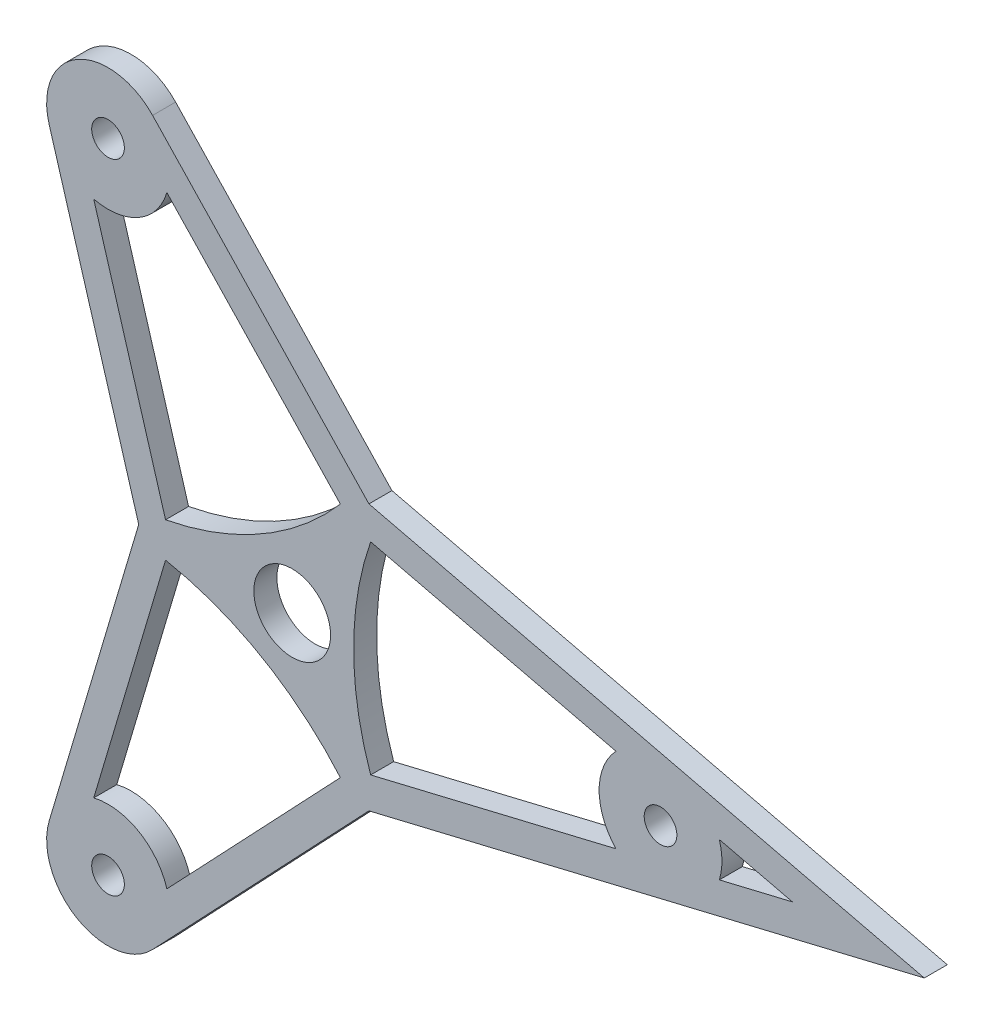
ISO-10303-21;
HEADER;
FILE_DESCRIPTION(('STEP AP214'),'2;1');
FILE_NAME('part.step','',(''),(''),'','','');
FILE_SCHEMA(('AUTOMOTIVE_DESIGN { 1 0 10303 214 1 1 1 1 }'));
ENDSEC;
DATA;
#1=APPLICATION_CONTEXT('core data for automotive mechanical design processes');
#2=APPLICATION_PROTOCOL_DEFINITION('international standard','automotive_design',2000,#1);
#3=PRODUCT_CONTEXT('',#1,'mechanical');
#4=PRODUCT('Part','Part','',(#3));
#5=PRODUCT_RELATED_PRODUCT_CATEGORY('part','',(#4));
#6=PRODUCT_DEFINITION_FORMATION('','',#4);
#7=PRODUCT_DEFINITION_CONTEXT('part definition',#1,'design');
#8=PRODUCT_DEFINITION('design','',#6,#7);
#9=PRODUCT_DEFINITION_SHAPE('','',#8);
#10=(LENGTH_UNIT() NAMED_UNIT(*) SI_UNIT(.MILLI.,.METRE.));
#11=(NAMED_UNIT(*) PLANE_ANGLE_UNIT() SI_UNIT($,.RADIAN.));
#12=(NAMED_UNIT(*) SI_UNIT($,.STERADIAN.) SOLID_ANGLE_UNIT());
#13=UNCERTAINTY_MEASURE_WITH_UNIT(LENGTH_MEASURE(1.E-05),#10,'distance_accuracy_value','');
#14=(GEOMETRIC_REPRESENTATION_CONTEXT(3) GLOBAL_UNCERTAINTY_ASSIGNED_CONTEXT((#13)) GLOBAL_UNIT_ASSIGNED_CONTEXT((#10,
#11,#12)) REPRESENTATION_CONTEXT('',''));
#15=CARTESIAN_POINT('',(0.,0.,0.));
#16=DIRECTION('',(0.,0.,1.));
#17=DIRECTION('',(1.,0.,0.));
#18=AXIS2_PLACEMENT_3D('',#15,#16,#17);
#19=CARTESIAN_POINT('',(-31.75,0.,-4.7625));
#20=DIRECTION('',(-0.958618679777918,0.284693215199875,0.));
#21=DIRECTION('',(-0.284693215199875,-0.958618679777918,0.));
#22=AXIS2_PLACEMENT_3D('',#19,#20,#21);
#23=PLANE('',#22);
#24=DIRECTION('',(-0.284693215199875,-0.958618679777918,0.));
#25=VECTOR('',#24,1.);
#26=CARTESIAN_POINT('',(-31.75,0.,0.));
#27=LINE('',#26,#25);
#28=CARTESIAN_POINT('',(-31.75,0.,0.));
#29=VERTEX_POINT('',#28);
#30=CARTESIAN_POINT('',(-50.2744572331796,-62.3755319353353,0.));
#31=VERTEX_POINT('',#30);
#32=EDGE_CURVE('E377',#29,#31,#27,.T.);
#33=ORIENTED_EDGE('',*,*,#32,.F.);
#34=DIRECTION('',(0.,0.,1.));
#35=VECTOR('',#34,1.);
#36=CARTESIAN_POINT('',(-31.75,0.,-4.7625));
#37=LINE('',#36,#35);
#38=CARTESIAN_POINT('',(-31.75,0.,-4.7625));
#39=VERTEX_POINT('',#38);
#40=EDGE_CURVE('E11',#39,#29,#37,.T.);
#41=ORIENTED_EDGE('',*,*,#40,.F.);
#42=DIRECTION('',(-0.284693215199875,-0.958618679777918,0.));
#43=VECTOR('',#42,1.);
#44=CARTESIAN_POINT('',(-31.75,0.,-4.7625));
#45=LINE('',#44,#43);
#46=CARTESIAN_POINT('',(-50.2744572331796,-62.3755319353353,-4.7625));
#47=VERTEX_POINT('',#46);
#48=EDGE_CURVE('E381',#39,#47,#45,.T.);
#49=ORIENTED_EDGE('',*,*,#48,.T.);
#50=DIRECTION('',(0.,0.,1.));
#51=VECTOR('',#50,1.);
#52=CARTESIAN_POINT('',(-50.2744572331796,-62.3755319353353,-4.7625));
#53=LINE('',#52,#51);
#54=EDGE_CURVE('E45',#47,#31,#53,.T.);
#55=ORIENTED_EDGE('',*,*,#54,.T.);
#56=EDGE_LOOP('',(#33,#41,#49,#55));
#57=FACE_BOUND('',#56,.T.);
#58=ADVANCED_FACE('F42',(#57),#23,.T.);
#59=CARTESIAN_POINT('',(-31.75,0.,-4.7625));
#60=DIRECTION('',(-0.95861867977792,-0.284693215199867,0.));
#61=DIRECTION('',(0.284693215199867,-0.95861867977792,0.));
#62=AXIS2_PLACEMENT_3D('',#59,#60,#61);
#63=PLANE('',#62);
#64=DIRECTION('',(0.284693215199867,-0.95861867977792,0.));
#65=VECTOR('',#64,1.);
#66=CARTESIAN_POINT('',(-31.75,0.,0.));
#67=LINE('',#66,#65);
#68=CARTESIAN_POINT('',(-50.2744572331791,62.3755319353358,0.));
#69=VERTEX_POINT('',#68);
#70=EDGE_CURVE('E386',#69,#29,#67,.T.);
#71=ORIENTED_EDGE('',*,*,#70,.F.);
#72=DIRECTION('',(0.,0.,1.));
#73=VECTOR('',#72,1.);
#74=CARTESIAN_POINT('',(-50.2744572331791,62.3755319353358,-4.7625));
#75=LINE('',#74,#73);
#76=CARTESIAN_POINT('',(-50.2744572331791,62.3755319353358,-4.7625));
#77=VERTEX_POINT('',#76);
#78=EDGE_CURVE('E51',#77,#69,#75,.T.);
#79=ORIENTED_EDGE('',*,*,#78,.F.);
#80=DIRECTION('',(0.284693215199867,-0.95861867977792,0.));
#81=VECTOR('',#80,1.);
#82=CARTESIAN_POINT('',(-31.75,0.,-4.7625));
#83=LINE('',#82,#81);
#84=EDGE_CURVE('E408',#77,#39,#83,.T.);
#85=ORIENTED_EDGE('',*,*,#84,.T.);
#86=ORIENTED_EDGE('',*,*,#40,.T.);
#87=EDGE_LOOP('',(#71,#79,#85,#86));
#88=FACE_BOUND('',#87,.T.);
#89=ADVANCED_FACE('F477',(#88),#63,.T.);
#90=CARTESIAN_POINT('',(-38.0999999999996,65.9911357683741,-4.7625));
#91=DIRECTION('',(0.,0.,1.));
#92=DIRECTION('',(1.,0.,0.));
#93=AXIS2_PLACEMENT_3D('',#90,#91,#92);
#94=CYLINDRICAL_SURFACE('',#93,12.7);
#95=CARTESIAN_POINT('',(-38.0999999999996,65.9911357683741,0.));
#96=DIRECTION('',(0.,0.,1.));
#97=DIRECTION('',(1.,0.,0.));
#98=AXIS2_PLACEMENT_3D('',#95,#96,#97);
#99=CIRCLE('',#98,12.7);
#100=CARTESIAN_POINT('',(-28.8815666139781,74.7267230930756,0.));
#101=VERTEX_POINT('',#100);
#102=EDGE_CURVE('E435',#101,#69,#99,.T.);
#103=ORIENTED_EDGE('',*,*,#102,.F.);
#104=DIRECTION('',(0.,0.,1.));
#105=VECTOR('',#104,1.);
#106=CARTESIAN_POINT('',(-28.8815666139781,74.7267230930756,-4.7625));
#107=LINE('',#106,#105);
#108=CARTESIAN_POINT('',(-28.8815666139781,74.7267230930756,-4.7625));
#109=VERTEX_POINT('',#108);
#110=EDGE_CURVE('E444',#109,#101,#107,.T.);
#111=ORIENTED_EDGE('',*,*,#110,.F.);
#112=CARTESIAN_POINT('',(-38.0999999999996,65.9911357683741,-4.7625));
#113=DIRECTION('',(0.,0.,1.));
#114=DIRECTION('',(1.,0.,0.));
#115=AXIS2_PLACEMENT_3D('',#112,#113,#114);
#116=CIRCLE('',#115,12.7);
#117=EDGE_CURVE('E404',#109,#77,#116,.T.);
#118=ORIENTED_EDGE('',*,*,#117,.T.);
#119=ORIENTED_EDGE('',*,*,#78,.T.);
#120=EDGE_LOOP('',(#103,#111,#118,#119));
#121=FACE_BOUND('',#120,.T.);
#122=ADVANCED_FACE('F497',(#121),#94,.T.);
#123=CARTESIAN_POINT('',(15.8749999999999,27.496306570156,-4.7625));
#124=DIRECTION('',(0.725860896537122,0.687841521630038,0.));
#125=DIRECTION('',(-0.687841521630038,0.725860896537122,0.));
#126=AXIS2_PLACEMENT_3D('',#123,#124,#125);
#127=PLANE('',#126);
#128=DIRECTION('',(-0.687841521630038,0.725860896537122,0.));
#129=VECTOR('',#128,1.);
#130=CARTESIAN_POINT('',(15.8749999999999,27.496306570156,0.));
#131=LINE('',#130,#129);
#132=CARTESIAN_POINT('',(15.8749999999999,27.496306570156,0.));
#133=VERTEX_POINT('',#132);
#134=EDGE_CURVE('E431',#133,#101,#131,.T.);
#135=ORIENTED_EDGE('',*,*,#134,.F.);
#136=DIRECTION('',(0.,0.,1.));
#137=VECTOR('',#136,1.);
#138=CARTESIAN_POINT('',(15.8749999999999,27.496306570156,-4.7625));
#139=LINE('',#138,#137);
#140=CARTESIAN_POINT('',(15.8749999999999,27.496306570156,-4.7625));
#141=VERTEX_POINT('',#140);
#142=EDGE_CURVE('E447',#141,#133,#139,.T.);
#143=ORIENTED_EDGE('',*,*,#142,.F.);
#144=DIRECTION('',(-0.687841521630038,0.725860896537122,0.));
#145=VECTOR('',#144,1.);
#146=CARTESIAN_POINT('',(15.8749999999999,27.496306570156,-4.7625));
#147=LINE('',#146,#145);
#148=EDGE_CURVE('E400',#141,#109,#147,.T.);
#149=ORIENTED_EDGE('',*,*,#148,.T.);
#150=ORIENTED_EDGE('',*,*,#110,.T.);
#151=EDGE_LOOP('',(#135,#143,#149,#150));
#152=FACE_BOUND('',#151,.T.);
#153=ADVANCED_FACE('F495',(#152),#127,.T.);
#154=CARTESIAN_POINT('',(15.8749999999999,27.496306570156,-4.7625));
#155=DIRECTION('',(0.232757783240804,0.972534736829912,0.));
#156=DIRECTION('',(-0.972534736829913,0.232757783240804,0.));
#157=AXIS2_PLACEMENT_3D('',#154,#155,#156);
#158=PLANE('',#157);
#159=DIRECTION('',(-0.972534736829912,0.232757783240804,0.));
#160=VECTOR('',#159,1.);
#161=CARTESIAN_POINT('',(15.8749999999999,27.496306570156,0.));
#162=LINE('',#161,#160);
#163=CARTESIAN_POINT('',(130.763159277303,-3.24393301264684E-13,0.));
#164=VERTEX_POINT('',#163);
#165=EDGE_CURVE('E427',#164,#133,#162,.T.);
#166=ORIENTED_EDGE('',*,*,#165,.F.);
#167=DIRECTION('',(0.,0.,1.));
#168=VECTOR('',#167,1.);
#169=CARTESIAN_POINT('',(130.763159277303,-3.24393301264684E-13,-4.7625));
#170=LINE('',#169,#168);
#171=CARTESIAN_POINT('',(130.763159277303,-3.24393301264684E-13,-4.7625));
#172=VERTEX_POINT('',#171);
#173=EDGE_CURVE('E450',#172,#164,#170,.T.);
#174=ORIENTED_EDGE('',*,*,#173,.F.);
#175=DIRECTION('',(-0.972534736829912,0.232757783240804,0.));
#176=VECTOR('',#175,1.);
#177=CARTESIAN_POINT('',(78.911198700198,12.4097854231473,-4.7625));
#178=LINE('',#177,#176);
#179=EDGE_CURVE('E397',#172,#141,#178,.T.);
#180=ORIENTED_EDGE('',*,*,#179,.T.);
#181=ORIENTED_EDGE('',*,*,#142,.T.);
#182=EDGE_LOOP('',(#166,#174,#180,#181));
#183=FACE_BOUND('',#182,.T.);
#184=ADVANCED_FACE('F490',(#183),#158,.T.);
#185=CARTESIAN_POINT('',(79.1560238471579,-12.3511911577401,-4.7625));
#186=DIRECTION('',(0.2327577832408,-0.972534736829913,0.));
#187=DIRECTION('',(0.972534736829913,0.2327577832408,0.));
#188=AXIS2_PLACEMENT_3D('',#185,#186,#187);
#189=PLANE('',#188);
#190=DIRECTION('',(0.972534736829913,0.2327577832408,0.));
#191=VECTOR('',#190,1.);
#192=CARTESIAN_POINT('',(79.1560238471579,-12.3511911577401,0.));
#193=LINE('',#192,#191);
#194=CARTESIAN_POINT('',(15.8749999999994,-27.4963065701563,0.));
#195=VERTEX_POINT('',#194);
#196=EDGE_CURVE('E423',#195,#164,#193,.T.);
#197=ORIENTED_EDGE('',*,*,#196,.F.);
#198=DIRECTION('',(0.,0.,1.));
#199=VECTOR('',#198,1.);
#200=CARTESIAN_POINT('',(15.8749999999994,-27.4963065701563,-4.7625));
#201=LINE('',#200,#199);
#202=CARTESIAN_POINT('',(15.8749999999994,-27.4963065701563,-4.7625));
#203=VERTEX_POINT('',#202);
#204=EDGE_CURVE('E454',#203,#195,#201,.T.);
#205=ORIENTED_EDGE('',*,*,#204,.F.);
#206=DIRECTION('',(0.972534736829913,0.2327577832408,0.));
#207=VECTOR('',#206,1.);
#208=CARTESIAN_POINT('',(15.8749999999994,-27.4963065701563,-4.7625));
#209=LINE('',#208,#207);
#210=EDGE_CURVE('E394',#203,#172,#209,.T.);
#211=ORIENTED_EDGE('',*,*,#210,.T.);
#212=ORIENTED_EDGE('',*,*,#173,.T.);
#213=EDGE_LOOP('',(#197,#205,#211,#212));
#214=FACE_BOUND('',#213,.T.);
#215=ADVANCED_FACE('F487',(#214),#189,.T.);
#216=CARTESIAN_POINT('',(15.8749999999994,-27.4963065701563,-4.7625));
#217=DIRECTION('',(0.725860896537117,-0.687841521630042,0.));
#218=DIRECTION('',(0.687841521630043,0.725860896537117,0.));
#219=AXIS2_PLACEMENT_3D('',#216,#217,#218);
#220=PLANE('',#219);
#221=DIRECTION('',(0.687841521630043,0.725860896537117,0.));
#222=VECTOR('',#221,1.);
#223=CARTESIAN_POINT('',(15.8749999999994,-27.4963065701563,0.));
#224=LINE('',#223,#222);
#225=CARTESIAN_POINT('',(-28.8815666139786,-74.7267230930753,0.));
#226=VERTEX_POINT('',#225);
#227=EDGE_CURVE('E419',#226,#195,#224,.T.);
#228=ORIENTED_EDGE('',*,*,#227,.F.);
#229=DIRECTION('',(0.,0.,1.));
#230=VECTOR('',#229,1.);
#231=CARTESIAN_POINT('',(-28.8815666139786,-74.7267230930753,-4.7625));
#232=LINE('',#231,#230);
#233=CARTESIAN_POINT('',(-28.8815666139786,-74.7267230930753,-4.7625));
#234=VERTEX_POINT('',#233);
#235=EDGE_CURVE('E457',#234,#226,#232,.T.);
#236=ORIENTED_EDGE('',*,*,#235,.F.);
#237=DIRECTION('',(0.687841521630043,0.725860896537117,0.));
#238=VECTOR('',#237,1.);
#239=CARTESIAN_POINT('',(15.8749999999994,-27.4963065701563,-4.7625));
#240=LINE('',#239,#238);
#241=EDGE_CURVE('E390',#234,#203,#240,.T.);
#242=ORIENTED_EDGE('',*,*,#241,.T.);
#243=ORIENTED_EDGE('',*,*,#204,.T.);
#244=EDGE_LOOP('',(#228,#236,#242,#243));
#245=FACE_BOUND('',#244,.T.);
#246=ADVANCED_FACE('F485',(#245),#220,.T.);
#247=CARTESIAN_POINT('',(-38.1,-65.9911357683737,-4.7625));
#248=DIRECTION('',(0.,0.,1.));
#249=DIRECTION('',(1.,0.,0.));
#250=AXIS2_PLACEMENT_3D('',#247,#248,#249);
#251=CYLINDRICAL_SURFACE('',#250,12.7);
#252=CARTESIAN_POINT('',(-38.1,-65.9911357683737,0.));
#253=DIRECTION('',(0.,0.,1.));
#254=DIRECTION('',(1.,0.,0.));
#255=AXIS2_PLACEMENT_3D('',#252,#253,#254);
#256=CIRCLE('',#255,12.7);
#257=EDGE_CURVE('E415',#31,#226,#256,.T.);
#258=ORIENTED_EDGE('',*,*,#257,.F.);
#259=ORIENTED_EDGE('',*,*,#54,.F.);
#260=CARTESIAN_POINT('',(-38.1,-65.9911357683737,-4.7625));
#261=DIRECTION('',(0.,0.,1.));
#262=DIRECTION('',(1.,0.,0.));
#263=AXIS2_PLACEMENT_3D('',#260,#261,#262);
#264=CIRCLE('',#263,12.7);
#265=EDGE_CURVE('E385',#47,#234,#264,.T.);
#266=ORIENTED_EDGE('',*,*,#265,.T.);
#267=ORIENTED_EDGE('',*,*,#235,.T.);
#268=EDGE_LOOP('',(#258,#259,#266,#267));
#269=FACE_BOUND('',#268,.T.);
#270=ADVANCED_FACE('F471',(#269),#251,.T.);
#271=CARTESIAN_POINT('',(-38.1,-65.9911357683737,-4.7625));
#272=DIRECTION('',(0.,0.,1.));
#273=DIRECTION('',(1.,0.,0.));
#274=AXIS2_PLACEMENT_3D('',#271,#272,#273);
#275=PLANE('',#274);
#276=CARTESIAN_POINT('',(76.2,0.,-4.7625));
#277=DIRECTION('',(0.,0.,1.));
#278=DIRECTION('',(1.,0.,0.));
#279=AXIS2_PLACEMENT_3D('',#276,#277,#278);
#280=CIRCLE('',#279,3.3782);
#281=CARTESIAN_POINT('',(79.5782,0.,-4.7625));
#282=VERTEX_POINT('',#281);
#283=EDGE_CURVE('E830',#282,#282,#280,.T.);
#284=ORIENTED_EDGE('',*,*,#283,.T.);
#285=EDGE_LOOP('',(#284));
#286=FACE_BOUND('',#285,.T.);
#287=CARTESIAN_POINT('',(-38.0999999999992,65.9911357683743,-4.7625));
#288=DIRECTION('',(0.,0.,1.));
#289=DIRECTION('',(1.,0.,0.));
#290=AXIS2_PLACEMENT_3D('',#287,#288,#289);
#291=CIRCLE('',#290,3.3782);
#292=CARTESIAN_POINT('',(-34.7217999999992,65.9911357683743,-4.7625));
#293=VERTEX_POINT('',#292);
#294=EDGE_CURVE('E845',#293,#293,#291,.T.);
#295=ORIENTED_EDGE('',*,*,#294,.T.);
#296=EDGE_LOOP('',(#295));
#297=FACE_BOUND('',#296,.T.);
#298=CARTESIAN_POINT('',(-38.0999999999997,-65.9911357683735,-4.7625));
#299=DIRECTION('',(0.,0.,1.));
#300=DIRECTION('',(1.,0.,0.));
#301=AXIS2_PLACEMENT_3D('',#298,#299,#300);
#302=CIRCLE('',#301,3.3782);
#303=CARTESIAN_POINT('',(-34.7217999999997,-65.9911357683735,-4.7625));
#304=VERTEX_POINT('',#303);
#305=EDGE_CURVE('E228',#304,#304,#302,.T.);
#306=ORIENTED_EDGE('',*,*,#305,.T.);
#307=EDGE_LOOP('',(#306));
#308=FACE_BOUND('',#307,.T.);
#309=DIRECTION('',(0.972534736829913,0.2327577832408,0.));
#310=VECTOR('',#309,1.);
#311=CARTESIAN_POINT('',(16.2316117473112,-20.8816285374198,-4.7625));
#312=LINE('',#311,#310);
#313=CARTESIAN_POINT('',(16.2316117473112,-20.8816285374198,-4.7625));
#314=VERTEX_POINT('',#313);
#315=CARTESIAN_POINT('',(66.9815666139783,-8.73558732470175,-4.7625));
#316=VERTEX_POINT('',#315);
#317=EDGE_CURVE('E207',#314,#316,#312,.T.);
#318=ORIENTED_EDGE('',*,*,#317,.T.);
#319=CARTESIAN_POINT('',(76.1999999999997,-2.17686979553376E-13,-4.7625));
#320=DIRECTION('',(0.,0.,-1.));
#321=DIRECTION('',(1.,0.,0.));
#322=AXIS2_PLACEMENT_3D('',#319,#320,#321);
#323=CIRCLE('',#322,12.7);
#324=CARTESIAN_POINT('',(66.9815666139783,8.73558732470135,-4.7625));
#325=VERTEX_POINT('',#324);
#326=EDGE_CURVE('E200',#316,#325,#323,.T.);
#327=ORIENTED_EDGE('',*,*,#326,.T.);
#328=DIRECTION('',(-0.972534736829913,0.232757783240804,0.));
#329=VECTOR('',#328,1.);
#330=CARTESIAN_POINT('',(16.2316117473113,20.8816285374197,-4.7625));
#331=LINE('',#330,#329);
#332=CARTESIAN_POINT('',(16.2316117473113,20.8816285374196,-4.7625));
#333=VERTEX_POINT('',#332);
#334=EDGE_CURVE('E210',#325,#333,#331,.T.);
#335=ORIENTED_EDGE('',*,*,#334,.T.);
#336=CARTESIAN_POINT('',(76.1999999999997,-2.17686979553376E-13,-4.7625));
#337=DIRECTION('',(0.,0.,1.));
#338=DIRECTION('',(1.,0.,0.));
#339=AXIS2_PLACEMENT_3D('',#336,#337,#338);
#340=CIRCLE('',#339,63.4999999999997);
#341=EDGE_CURVE('E59',#333,#314,#340,.T.);
#342=ORIENTED_EDGE('',*,*,#341,.T.);
#343=EDGE_LOOP('',(#318,#327,#335,#342));
#344=FACE_BOUND('',#343,.T.);
#345=DIRECTION('',(-0.284693215199875,-0.958618679777917,0.));
#346=VECTOR('',#345,1.);
#347=CARTESIAN_POINT('',(-26.1998266594511,-3.61617384882755,-4.7625));
#348=LINE('',#347,#346);
#349=CARTESIAN_POINT('',(-26.1998266594511,-3.61617384882756,-4.7625));
#350=VERTEX_POINT('',#349);
#351=CARTESIAN_POINT('',(-41.0560238471581,-53.6399446106338,-4.7625));
#352=VERTEX_POINT('',#351);
#353=EDGE_CURVE('E265',#350,#352,#348,.T.);
#354=ORIENTED_EDGE('',*,*,#353,.T.);
#355=CARTESIAN_POINT('',(-38.1,-65.9911357683737,-4.7625));
#356=DIRECTION('',(0.,0.,-1.));
#357=DIRECTION('',(1.,0.,0.));
#358=AXIS2_PLACEMENT_3D('',#355,#356,#357);
#359=CIRCLE('',#358,12.7);
#360=CARTESIAN_POINT('',(-25.9255427668204,-62.3755319353354,-4.7625));
#361=VERTEX_POINT('',#360);
#362=EDGE_CURVE('E252',#352,#361,#359,.T.);
#363=ORIENTED_EDGE('',*,*,#362,.T.);
#364=DIRECTION('',(0.687841521630043,0.725860896537117,0.));
#365=VECTOR('',#364,1.);
#366=CARTESIAN_POINT('',(9.96821491213968,-24.4978023862472,-4.7625));
#367=LINE('',#366,#365);
#368=CARTESIAN_POINT('',(9.96821491213969,-24.4978023862472,-4.7625));
#369=VERTEX_POINT('',#368);
#370=EDGE_CURVE('E256',#361,#369,#367,.T.);
#371=ORIENTED_EDGE('',*,*,#370,.T.);
#372=CARTESIAN_POINT('',(-38.1,-65.9911357683737,-4.7625));
#373=DIRECTION('',(0.,0.,1.));
#374=DIRECTION('',(1.,0.,0.));
#375=AXIS2_PLACEMENT_3D('',#372,#373,#374);
#376=CIRCLE('',#375,63.4999999999996);
#377=EDGE_CURVE('E261',#369,#350,#376,.T.);
#378=ORIENTED_EDGE('',*,*,#377,.T.);
#379=EDGE_LOOP('',(#354,#363,#371,#378));
#380=FACE_BOUND('',#379,.T.);
#381=DIRECTION('',(-0.972534736829912,0.232757783240804,0.));
#382=VECTOR('',#381,1.);
#383=CARTESIAN_POINT('',(88.3744572331793,3.61560383303811,-4.7625));
#384=LINE('',#383,#382);
#385=CARTESIAN_POINT('',(103.481579638652,-2.63677968348475E-13,-4.7625));
#386=VERTEX_POINT('',#385);
#387=CARTESIAN_POINT('',(88.3744572331793,3.61560383303811,-4.7625));
#388=VERTEX_POINT('',#387);
#389=EDGE_CURVE('E305',#386,#388,#384,.T.);
#390=ORIENTED_EDGE('',*,*,#389,.T.);
#391=CARTESIAN_POINT('',(76.1999999999997,-2.17686979553376E-13,-4.7625));
#392=DIRECTION('',(0.,0.,-1.));
#393=DIRECTION('',(1.,0.,0.));
#394=AXIS2_PLACEMENT_3D('',#391,#392,#393);
#395=CIRCLE('',#394,12.7);
#396=CARTESIAN_POINT('',(88.3744572331793,-3.61560383303859,-4.7625));
#397=VERTEX_POINT('',#396);
#398=EDGE_CURVE('E296',#388,#397,#395,.T.);
#399=ORIENTED_EDGE('',*,*,#398,.T.);
#400=DIRECTION('',(0.972534736829913,0.2327577832408,0.));
#401=VECTOR('',#400,1.);
#402=CARTESIAN_POINT('',(88.3744572331793,-3.61560383303859,-4.7625));
#403=LINE('',#402,#401);
#404=EDGE_CURVE('E300',#397,#386,#403,.T.);
#405=ORIENTED_EDGE('',*,*,#404,.T.);
#406=EDGE_LOOP('',(#390,#399,#405));
#407=FACE_BOUND('',#406,.T.);
#408=DIRECTION('',(-0.687841521630038,0.725860896537122,0.));
#409=VECTOR('',#408,1.);
#410=CARTESIAN_POINT('',(9.96821491213995,24.4978023862472,-4.7625));
#411=LINE('',#410,#409);
#412=CARTESIAN_POINT('',(9.96821491213995,24.4978023862472,-4.7625));
#413=VERTEX_POINT('',#412);
#414=CARTESIAN_POINT('',(-25.92554276682,62.3755319353357,-4.7625));
#415=VERTEX_POINT('',#414);
#416=EDGE_CURVE('E342',#413,#415,#411,.T.);
#417=ORIENTED_EDGE('',*,*,#416,.T.);
#418=CARTESIAN_POINT('',(-38.0999999999996,65.9911357683741,-4.7625));
#419=DIRECTION('',(0.,0.,-1.));
#420=DIRECTION('',(1.,0.,0.));
#421=AXIS2_PLACEMENT_3D('',#418,#419,#420);
#422=CIRCLE('',#421,12.7);
#423=CARTESIAN_POINT('',(-41.0560238471578,53.6399446106342,-4.7625));
#424=VERTEX_POINT('',#423);
#425=EDGE_CURVE('E329',#415,#424,#422,.T.);
#426=ORIENTED_EDGE('',*,*,#425,.T.);
#427=DIRECTION('',(0.284693215199867,-0.95861867977792,0.));
#428=VECTOR('',#427,1.);
#429=CARTESIAN_POINT('',(-26.1998266594511,3.61617384882772,-4.7625));
#430=LINE('',#429,#428);
#431=CARTESIAN_POINT('',(-26.1998266594511,3.61617384882773,-4.7625));
#432=VERTEX_POINT('',#431);
#433=EDGE_CURVE('E333',#424,#432,#430,.T.);
#434=ORIENTED_EDGE('',*,*,#433,.T.);
#435=CARTESIAN_POINT('',(-38.0999999999996,65.9911357683741,-4.7625));
#436=DIRECTION('',(0.,0.,1.));
#437=DIRECTION('',(1.,0.,0.));
#438=AXIS2_PLACEMENT_3D('',#435,#436,#437);
#439=CIRCLE('',#438,63.4999999999997);
#440=EDGE_CURVE('E338',#432,#413,#439,.T.);
#441=ORIENTED_EDGE('',*,*,#440,.T.);
#442=EDGE_LOOP('',(#417,#426,#434,#441));
#443=FACE_BOUND('',#442,.T.);
#444=CARTESIAN_POINT('',(0.,0.,-4.7625));
#445=DIRECTION('',(0.,0.,1.));
#446=DIRECTION('',(1.,0.,0.));
#447=AXIS2_PLACEMENT_3D('',#444,#445,#446);
#448=CIRCLE('',#447,7.9375);
#449=CARTESIAN_POINT('',(7.9375,0.,-4.7625));
#450=VERTEX_POINT('',#449);
#451=EDGE_CURVE('E373',#450,#450,#448,.T.);
#452=ORIENTED_EDGE('',*,*,#451,.T.);
#453=EDGE_LOOP('',(#452));
#454=FACE_BOUND('',#453,.T.);
#455=ORIENTED_EDGE('',*,*,#48,.F.);
#456=ORIENTED_EDGE('',*,*,#84,.F.);
#457=ORIENTED_EDGE('',*,*,#117,.F.);
#458=ORIENTED_EDGE('',*,*,#148,.F.);
#459=ORIENTED_EDGE('',*,*,#179,.F.);
#460=ORIENTED_EDGE('',*,*,#210,.F.);
#461=ORIENTED_EDGE('',*,*,#241,.F.);
#462=ORIENTED_EDGE('',*,*,#265,.F.);
#463=EDGE_LOOP('',(#455,#456,#457,#458,#459,#460,#461,#462));
#464=FACE_BOUND('',#463,.T.);
#465=ADVANCED_FACE('F215',(#286,#297,#308,#344,#380,#407,#443,#454,#464),#275,.F.);
#466=CARTESIAN_POINT('',(-38.1,-65.9911357683737,0.));
#467=DIRECTION('',(0.,0.,1.));
#468=DIRECTION('',(1.,0.,0.));
#469=AXIS2_PLACEMENT_3D('',#466,#467,#468);
#470=PLANE('',#469);
#471=CARTESIAN_POINT('',(76.2,0.,0.));
#472=DIRECTION('',(0.,0.,1.));
#473=DIRECTION('',(1.,0.,0.));
#474=AXIS2_PLACEMENT_3D('',#471,#472,#473);
#475=CIRCLE('',#474,3.37819999999998);
#476=CARTESIAN_POINT('',(79.5782,0.,0.));
#477=VERTEX_POINT('',#476);
#478=EDGE_CURVE('E833',#477,#477,#475,.T.);
#479=ORIENTED_EDGE('',*,*,#478,.F.);
#480=EDGE_LOOP('',(#479));
#481=FACE_BOUND('',#480,.T.);
#482=CARTESIAN_POINT('',(-38.0999999999992,65.9911357683743,0.));
#483=DIRECTION('',(0.,0.,1.));
#484=DIRECTION('',(1.,0.,0.));
#485=AXIS2_PLACEMENT_3D('',#482,#483,#484);
#486=CIRCLE('',#485,3.37819999999998);
#487=CARTESIAN_POINT('',(-34.7217999999993,65.9911357683743,0.));
#488=VERTEX_POINT('',#487);
#489=EDGE_CURVE('E839',#488,#488,#486,.T.);
#490=ORIENTED_EDGE('',*,*,#489,.F.);
#491=EDGE_LOOP('',(#490));
#492=FACE_BOUND('',#491,.T.);
#493=CARTESIAN_POINT('',(-38.0999999999997,-65.9911357683735,0.));
#494=DIRECTION('',(0.,0.,1.));
#495=DIRECTION('',(1.,0.,0.));
#496=AXIS2_PLACEMENT_3D('',#493,#494,#495);
#497=CIRCLE('',#496,3.37819999999998);
#498=CARTESIAN_POINT('',(-34.7217999999997,-65.9911357683735,0.));
#499=VERTEX_POINT('',#498);
#500=EDGE_CURVE('E848',#499,#499,#497,.T.);
#501=ORIENTED_EDGE('',*,*,#500,.F.);
#502=EDGE_LOOP('',(#501));
#503=FACE_BOUND('',#502,.T.);
#504=CARTESIAN_POINT('',(76.1999999999997,-2.17686979553376E-13,0.));
#505=DIRECTION('',(0.,0.,-1.));
#506=DIRECTION('',(1.,0.,0.));
#507=AXIS2_PLACEMENT_3D('',#504,#505,#506);
#508=CIRCLE('',#507,12.7);
#509=CARTESIAN_POINT('',(66.9815666139783,-8.73558732470175,0.));
#510=VERTEX_POINT('',#509);
#511=CARTESIAN_POINT('',(66.9815666139783,8.73558732470133,0.));
#512=VERTEX_POINT('',#511);
#513=EDGE_CURVE('E67',#510,#512,#508,.T.);
#514=ORIENTED_EDGE('',*,*,#513,.F.);
#515=DIRECTION('',(0.972534736829913,0.2327577832408,0.));
#516=VECTOR('',#515,1.);
#517=CARTESIAN_POINT('',(16.2316117473112,-20.8816285374198,0.));
#518=LINE('',#517,#516);
#519=CARTESIAN_POINT('',(16.2316117473112,-20.8816285374198,0.));
#520=VERTEX_POINT('',#519);
#521=EDGE_CURVE('E219',#520,#510,#518,.T.);
#522=ORIENTED_EDGE('',*,*,#521,.F.);
#523=CARTESIAN_POINT('',(76.1999999999997,-2.17686979553376E-13,0.));
#524=DIRECTION('',(0.,0.,1.));
#525=DIRECTION('',(1.,0.,0.));
#526=AXIS2_PLACEMENT_3D('',#523,#524,#525);
#527=CIRCLE('',#526,63.4999999999997);
#528=CARTESIAN_POINT('',(16.2316117473113,20.8816285374197,0.));
#529=VERTEX_POINT('',#528);
#530=EDGE_CURVE('E225',#529,#520,#527,.T.);
#531=ORIENTED_EDGE('',*,*,#530,.F.);
#532=DIRECTION('',(-0.972534736829913,0.232757783240804,0.));
#533=VECTOR('',#532,1.);
#534=CARTESIAN_POINT('',(16.2316117473113,20.8816285374197,0.));
#535=LINE('',#534,#533);
#536=EDGE_CURVE('E237',#512,#529,#535,.T.);
#537=ORIENTED_EDGE('',*,*,#536,.F.);
#538=EDGE_LOOP('',(#514,#522,#531,#537));
#539=FACE_BOUND('',#538,.T.);
#540=CARTESIAN_POINT('',(-38.1,-65.9911357683737,0.));
#541=DIRECTION('',(0.,0.,-1.));
#542=DIRECTION('',(1.,0.,0.));
#543=AXIS2_PLACEMENT_3D('',#540,#541,#542);
#544=CIRCLE('',#543,12.7);
#545=CARTESIAN_POINT('',(-41.0560238471581,-53.6399446106338,0.));
#546=VERTEX_POINT('',#545);
#547=CARTESIAN_POINT('',(-25.9255427668204,-62.3755319353354,0.));
#548=VERTEX_POINT('',#547);
#549=EDGE_CURVE('E246',#546,#548,#544,.T.);
#550=ORIENTED_EDGE('',*,*,#549,.F.);
#551=DIRECTION('',(-0.284693215199875,-0.958618679777917,0.));
#552=VECTOR('',#551,1.);
#553=CARTESIAN_POINT('',(-26.1998266594511,-3.61617384882755,0.));
#554=LINE('',#553,#552);
#555=CARTESIAN_POINT('',(-26.1998266594511,-3.61617384882756,0.));
#556=VERTEX_POINT('',#555);
#557=EDGE_CURVE('E257',#556,#546,#554,.T.);
#558=ORIENTED_EDGE('',*,*,#557,.F.);
#559=CARTESIAN_POINT('',(-38.1,-65.9911357683737,0.));
#560=DIRECTION('',(0.,0.,1.));
#561=DIRECTION('',(1.,0.,0.));
#562=AXIS2_PLACEMENT_3D('',#559,#560,#561);
#563=CIRCLE('',#562,63.4999999999996);
#564=CARTESIAN_POINT('',(9.96821491213968,-24.4978023862472,0.));
#565=VERTEX_POINT('',#564);
#566=EDGE_CURVE('E276',#565,#556,#563,.T.);
#567=ORIENTED_EDGE('',*,*,#566,.F.);
#568=DIRECTION('',(0.687841521630043,0.725860896537117,0.));
#569=VECTOR('',#568,1.);
#570=CARTESIAN_POINT('',(9.96821491213968,-24.4978023862472,0.));
#571=LINE('',#570,#569);
#572=EDGE_CURVE('E272',#548,#565,#571,.T.);
#573=ORIENTED_EDGE('',*,*,#572,.F.);
#574=EDGE_LOOP('',(#550,#558,#567,#573));
#575=FACE_BOUND('',#574,.T.);
#576=CARTESIAN_POINT('',(76.1999999999997,-2.17686979553376E-13,0.));
#577=DIRECTION('',(0.,0.,-1.));
#578=DIRECTION('',(1.,0.,0.));
#579=AXIS2_PLACEMENT_3D('',#576,#577,#578);
#580=CIRCLE('',#579,12.7);
#581=CARTESIAN_POINT('',(88.3744572331793,3.61560383303811,0.));
#582=VERTEX_POINT('',#581);
#583=CARTESIAN_POINT('',(88.3744572331793,-3.61560383303858,0.));
#584=VERTEX_POINT('',#583);
#585=EDGE_CURVE('E286',#582,#584,#580,.T.);
#586=ORIENTED_EDGE('',*,*,#585,.F.);
#587=DIRECTION('',(-0.972534736829912,0.232757783240804,0.));
#588=VECTOR('',#587,1.);
#589=CARTESIAN_POINT('',(88.3744572331793,3.61560383303811,0.));
#590=LINE('',#589,#588);
#591=CARTESIAN_POINT('',(103.481579638652,-2.72351585728359E-13,0.));
#592=VERTEX_POINT('',#591);
#593=EDGE_CURVE('E301',#592,#582,#590,.T.);
#594=ORIENTED_EDGE('',*,*,#593,.F.);
#595=DIRECTION('',(0.972534736829913,0.2327577832408,0.));
#596=VECTOR('',#595,1.);
#597=CARTESIAN_POINT('',(88.3744572331793,-3.61560383303859,0.));
#598=LINE('',#597,#596);
#599=EDGE_CURVE('E312',#584,#592,#598,.T.);
#600=ORIENTED_EDGE('',*,*,#599,.F.);
#601=EDGE_LOOP('',(#586,#594,#600));
#602=FACE_BOUND('',#601,.T.);
#603=CARTESIAN_POINT('',(-38.0999999999996,65.9911357683741,0.));
#604=DIRECTION('',(0.,0.,-1.));
#605=DIRECTION('',(1.,0.,0.));
#606=AXIS2_PLACEMENT_3D('',#603,#604,#605);
#607=CIRCLE('',#606,12.7);
#608=CARTESIAN_POINT('',(-25.92554276682,62.3755319353357,0.));
#609=VERTEX_POINT('',#608);
#610=CARTESIAN_POINT('',(-41.0560238471578,53.6399446106342,0.));
#611=VERTEX_POINT('',#610);
#612=EDGE_CURVE('E322',#609,#611,#607,.T.);
#613=ORIENTED_EDGE('',*,*,#612,.F.);
#614=DIRECTION('',(-0.687841521630038,0.725860896537122,0.));
#615=VECTOR('',#614,1.);
#616=CARTESIAN_POINT('',(9.96821491213995,24.4978023862472,0.));
#617=LINE('',#616,#615);
#618=CARTESIAN_POINT('',(9.96821491213995,24.4978023862472,0.));
#619=VERTEX_POINT('',#618);
#620=EDGE_CURVE('E334',#619,#609,#617,.T.);
#621=ORIENTED_EDGE('',*,*,#620,.F.);
#622=CARTESIAN_POINT('',(-38.0999999999996,65.9911357683741,0.));
#623=DIRECTION('',(0.,0.,1.));
#624=DIRECTION('',(1.,0.,0.));
#625=AXIS2_PLACEMENT_3D('',#622,#623,#624);
#626=CIRCLE('',#625,63.4999999999997);
#627=CARTESIAN_POINT('',(-26.1998266594511,3.61617384882773,0.));
#628=VERTEX_POINT('',#627);
#629=EDGE_CURVE('E353',#628,#619,#626,.T.);
#630=ORIENTED_EDGE('',*,*,#629,.F.);
#631=DIRECTION('',(0.284693215199867,-0.95861867977792,0.));
#632=VECTOR('',#631,1.);
#633=CARTESIAN_POINT('',(-26.1998266594511,3.61617384882772,0.));
#634=LINE('',#633,#632);
#635=EDGE_CURVE('E349',#611,#628,#634,.T.);
#636=ORIENTED_EDGE('',*,*,#635,.F.);
#637=EDGE_LOOP('',(#613,#621,#630,#636));
#638=FACE_BOUND('',#637,.T.);
#639=CARTESIAN_POINT('',(0.,0.,0.));
#640=DIRECTION('',(0.,0.,1.));
#641=DIRECTION('',(1.,0.,0.));
#642=AXIS2_PLACEMENT_3D('',#639,#640,#641);
#643=CIRCLE('',#642,7.9375);
#644=CARTESIAN_POINT('',(7.9375,0.,0.));
#645=VERTEX_POINT('',#644);
#646=EDGE_CURVE('E363',#645,#645,#643,.T.);
#647=ORIENTED_EDGE('',*,*,#646,.F.);
#648=EDGE_LOOP('',(#647));
#649=FACE_BOUND('',#648,.T.);
#650=ORIENTED_EDGE('',*,*,#32,.T.);
#651=ORIENTED_EDGE('',*,*,#257,.T.);
#652=ORIENTED_EDGE('',*,*,#227,.T.);
#653=ORIENTED_EDGE('',*,*,#196,.T.);
#654=ORIENTED_EDGE('',*,*,#165,.T.);
#655=ORIENTED_EDGE('',*,*,#134,.T.);
#656=ORIENTED_EDGE('',*,*,#102,.T.);
#657=ORIENTED_EDGE('',*,*,#70,.T.);
#658=EDGE_LOOP('',(#650,#651,#652,#653,#654,#655,#656,#657));
#659=FACE_BOUND('',#658,.T.);
#660=ADVANCED_FACE('F473',(#481,#492,#503,#539,#575,#602,#638,#649,#659),#470,.T.);
#661=CARTESIAN_POINT('',(0.,0.,-4.7625));
#662=DIRECTION('',(0.,0.,1.));
#663=DIRECTION('',(1.,0.,0.));
#664=AXIS2_PLACEMENT_3D('',#661,#662,#663);
#665=CYLINDRICAL_SURFACE('',#664,7.9375);
#666=ORIENTED_EDGE('',*,*,#451,.F.);
#667=EDGE_LOOP('',(#666));
#668=FACE_BOUND('',#667,.T.);
#669=ORIENTED_EDGE('',*,*,#646,.T.);
#670=EDGE_LOOP('',(#669));
#671=FACE_BOUND('',#670,.T.);
#672=ADVANCED_FACE('F574',(#668,#671),#665,.F.);
#673=CARTESIAN_POINT('',(-38.0999999999996,65.9911357683741,-4.7625));
#674=DIRECTION('',(0.,0.,1.));
#675=DIRECTION('',(1.,0.,0.));
#676=AXIS2_PLACEMENT_3D('',#673,#674,#675);
#677=CYLINDRICAL_SURFACE('',#676,12.7);
#678=ORIENTED_EDGE('',*,*,#612,.T.);
#679=DIRECTION('',(0.,0.,1.));
#680=VECTOR('',#679,1.);
#681=CARTESIAN_POINT('',(-41.0560238471578,53.6399446106342,-4.7625));
#682=LINE('',#681,#680);
#683=EDGE_CURVE('E346',#424,#611,#682,.T.);
#684=ORIENTED_EDGE('',*,*,#683,.F.);
#685=ORIENTED_EDGE('',*,*,#425,.F.);
#686=DIRECTION('',(0.,0.,1.));
#687=VECTOR('',#686,1.);
#688=CARTESIAN_POINT('',(-25.92554276682,62.3755319353357,-4.7625));
#689=LINE('',#688,#687);
#690=EDGE_CURVE('E360',#415,#609,#689,.T.);
#691=ORIENTED_EDGE('',*,*,#690,.T.);
#692=EDGE_LOOP('',(#678,#684,#685,#691));
#693=FACE_BOUND('',#692,.T.);
#694=ADVANCED_FACE('F584',(#693),#677,.T.);
#695=CARTESIAN_POINT('',(9.96821491213995,24.4978023862472,-4.7625));
#696=DIRECTION('',(0.725860896537122,0.687841521630038,0.));
#697=DIRECTION('',(-0.687841521630038,0.725860896537122,0.));
#698=AXIS2_PLACEMENT_3D('',#695,#696,#697);
#699=PLANE('',#698);
#700=ORIENTED_EDGE('',*,*,#620,.T.);
#701=ORIENTED_EDGE('',*,*,#690,.F.);
#702=ORIENTED_EDGE('',*,*,#416,.F.);
#703=DIRECTION('',(0.,0.,1.));
#704=VECTOR('',#703,1.);
#705=CARTESIAN_POINT('',(9.96821491213995,24.4978023862472,-4.7625));
#706=LINE('',#705,#704);
#707=EDGE_CURVE('E364',#413,#619,#706,.T.);
#708=ORIENTED_EDGE('',*,*,#707,.T.);
#709=EDGE_LOOP('',(#700,#701,#702,#708));
#710=FACE_BOUND('',#709,.T.);
#711=ADVANCED_FACE('F594',(#710),#699,.F.);
#712=CARTESIAN_POINT('',(-38.0999999999996,65.9911357683741,-4.7625));
#713=DIRECTION('',(0.,0.,1.));
#714=DIRECTION('',(1.,0.,0.));
#715=AXIS2_PLACEMENT_3D('',#712,#713,#714);
#716=CYLINDRICAL_SURFACE('',#715,63.4999999999997);
#717=ORIENTED_EDGE('',*,*,#629,.T.);
#718=ORIENTED_EDGE('',*,*,#707,.F.);
#719=ORIENTED_EDGE('',*,*,#440,.F.);
#720=DIRECTION('',(0.,0.,1.));
#721=VECTOR('',#720,1.);
#722=CARTESIAN_POINT('',(-26.1998266594511,3.61617384882773,-4.7625));
#723=LINE('',#722,#721);
#724=EDGE_CURVE('E367',#432,#628,#723,.T.);
#725=ORIENTED_EDGE('',*,*,#724,.T.);
#726=EDGE_LOOP('',(#717,#718,#719,#725));
#727=FACE_BOUND('',#726,.T.);
#728=ADVANCED_FACE('F604',(#727),#716,.F.);
#729=CARTESIAN_POINT('',(-26.1998266594511,3.61617384882772,-4.7625));
#730=DIRECTION('',(-0.95861867977792,-0.284693215199867,0.));
#731=DIRECTION('',(0.284693215199867,-0.95861867977792,0.));
#732=AXIS2_PLACEMENT_3D('',#729,#730,#731);
#733=PLANE('',#732);
#734=ORIENTED_EDGE('',*,*,#635,.T.);
#735=ORIENTED_EDGE('',*,*,#724,.F.);
#736=ORIENTED_EDGE('',*,*,#433,.F.);
#737=ORIENTED_EDGE('',*,*,#683,.T.);
#738=EDGE_LOOP('',(#734,#735,#736,#737));
#739=FACE_BOUND('',#738,.T.);
#740=ADVANCED_FACE('F614',(#739),#733,.F.);
#741=CARTESIAN_POINT('',(76.1999999999997,-2.17686979553376E-13,-4.7625));
#742=DIRECTION('',(0.,0.,1.));
#743=DIRECTION('',(1.,0.,0.));
#744=AXIS2_PLACEMENT_3D('',#741,#742,#743);
#745=CYLINDRICAL_SURFACE('',#744,12.7);
#746=ORIENTED_EDGE('',*,*,#585,.T.);
#747=DIRECTION('',(0.,0.,1.));
#748=VECTOR('',#747,1.);
#749=CARTESIAN_POINT('',(88.3744572331793,-3.61560383303859,-4.7625));
#750=LINE('',#749,#748);
#751=EDGE_CURVE('E309',#397,#584,#750,.T.);
#752=ORIENTED_EDGE('',*,*,#751,.F.);
#753=ORIENTED_EDGE('',*,*,#398,.F.);
#754=DIRECTION('',(0.,0.,1.));
#755=VECTOR('',#754,1.);
#756=CARTESIAN_POINT('',(88.3744572331793,3.61560383303811,-4.7625));
#757=LINE('',#756,#755);
#758=EDGE_CURVE('E319',#388,#582,#757,.T.);
#759=ORIENTED_EDGE('',*,*,#758,.T.);
#760=EDGE_LOOP('',(#746,#752,#753,#759));
#761=FACE_BOUND('',#760,.T.);
#762=ADVANCED_FACE('F624',(#761),#745,.T.);
#763=CARTESIAN_POINT('',(88.3744572331793,3.61560383303811,-4.7625));
#764=DIRECTION('',(0.232757783240804,0.972534736829912,0.));
#765=DIRECTION('',(-0.972534736829913,0.232757783240804,0.));
#766=AXIS2_PLACEMENT_3D('',#763,#764,#765);
#767=PLANE('',#766);
#768=ORIENTED_EDGE('',*,*,#593,.T.);
#769=ORIENTED_EDGE('',*,*,#758,.F.);
#770=ORIENTED_EDGE('',*,*,#389,.F.);
#771=DIRECTION('',(0.,0.,1.));
#772=VECTOR('',#771,1.);
#773=CARTESIAN_POINT('',(103.481579638652,-2.72351585728359E-13,-4.7625));
#774=LINE('',#773,#772);
#775=EDGE_CURVE('E323',#386,#592,#774,.T.);
#776=ORIENTED_EDGE('',*,*,#775,.T.);
#777=EDGE_LOOP('',(#768,#769,#770,#776));
#778=FACE_BOUND('',#777,.T.);
#779=ADVANCED_FACE('F634',(#778),#767,.F.);
#780=CARTESIAN_POINT('',(88.3744572331793,-3.61560383303859,-4.7625));
#781=DIRECTION('',(0.2327577832408,-0.972534736829913,0.));
#782=DIRECTION('',(0.972534736829913,0.2327577832408,0.));
#783=AXIS2_PLACEMENT_3D('',#780,#781,#782);
#784=PLANE('',#783);
#785=ORIENTED_EDGE('',*,*,#599,.T.);
#786=ORIENTED_EDGE('',*,*,#775,.F.);
#787=ORIENTED_EDGE('',*,*,#404,.F.);
#788=ORIENTED_EDGE('',*,*,#751,.T.);
#789=EDGE_LOOP('',(#785,#786,#787,#788));
#790=FACE_BOUND('',#789,.T.);
#791=ADVANCED_FACE('F644',(#790),#784,.F.);
#792=CARTESIAN_POINT('',(-38.1,-65.9911357683737,-4.7625));
#793=DIRECTION('',(0.,0.,1.));
#794=DIRECTION('',(1.,0.,0.));
#795=AXIS2_PLACEMENT_3D('',#792,#793,#794);
#796=CYLINDRICAL_SURFACE('',#795,12.7);
#797=ORIENTED_EDGE('',*,*,#549,.T.);
#798=DIRECTION('',(0.,0.,1.));
#799=VECTOR('',#798,1.);
#800=CARTESIAN_POINT('',(-25.9255427668204,-62.3755319353354,-4.7625));
#801=LINE('',#800,#799);
#802=EDGE_CURVE('E269',#361,#548,#801,.T.);
#803=ORIENTED_EDGE('',*,*,#802,.F.);
#804=ORIENTED_EDGE('',*,*,#362,.F.);
#805=DIRECTION('',(0.,0.,1.));
#806=VECTOR('',#805,1.);
#807=CARTESIAN_POINT('',(-41.0560238471581,-53.6399446106338,-4.7625));
#808=LINE('',#807,#806);
#809=EDGE_CURVE('E283',#352,#546,#808,.T.);
#810=ORIENTED_EDGE('',*,*,#809,.T.);
#811=EDGE_LOOP('',(#797,#803,#804,#810));
#812=FACE_BOUND('',#811,.T.);
#813=ADVANCED_FACE('F654',(#812),#796,.T.);
#814=CARTESIAN_POINT('',(-26.1998266594511,-3.61617384882755,-4.7625));
#815=DIRECTION('',(-0.958618679777918,0.284693215199875,0.));
#816=DIRECTION('',(-0.284693215199875,-0.958618679777918,0.));
#817=AXIS2_PLACEMENT_3D('',#814,#815,#816);
#818=PLANE('',#817);
#819=ORIENTED_EDGE('',*,*,#557,.T.);
#820=ORIENTED_EDGE('',*,*,#809,.F.);
#821=ORIENTED_EDGE('',*,*,#353,.F.);
#822=DIRECTION('',(0.,0.,1.));
#823=VECTOR('',#822,1.);
#824=CARTESIAN_POINT('',(-26.1998266594511,-3.61617384882756,-4.7625));
#825=LINE('',#824,#823);
#826=EDGE_CURVE('E287',#350,#556,#825,.T.);
#827=ORIENTED_EDGE('',*,*,#826,.T.);
#828=EDGE_LOOP('',(#819,#820,#821,#827));
#829=FACE_BOUND('',#828,.T.);
#830=ADVANCED_FACE('F664',(#829),#818,.F.);
#831=CARTESIAN_POINT('',(-38.1,-65.9911357683737,-4.7625));
#832=DIRECTION('',(0.,0.,1.));
#833=DIRECTION('',(1.,0.,0.));
#834=AXIS2_PLACEMENT_3D('',#831,#832,#833);
#835=CYLINDRICAL_SURFACE('',#834,63.4999999999996);
#836=ORIENTED_EDGE('',*,*,#566,.T.);
#837=ORIENTED_EDGE('',*,*,#826,.F.);
#838=ORIENTED_EDGE('',*,*,#377,.F.);
#839=DIRECTION('',(0.,0.,1.));
#840=VECTOR('',#839,1.);
#841=CARTESIAN_POINT('',(9.96821491213968,-24.4978023862472,-4.7625));
#842=LINE('',#841,#840);
#843=EDGE_CURVE('E290',#369,#565,#842,.T.);
#844=ORIENTED_EDGE('',*,*,#843,.T.);
#845=EDGE_LOOP('',(#836,#837,#838,#844));
#846=FACE_BOUND('',#845,.T.);
#847=ADVANCED_FACE('F674',(#846),#835,.F.);
#848=CARTESIAN_POINT('',(9.96821491213968,-24.4978023862472,-4.7625));
#849=DIRECTION('',(0.725860896537117,-0.687841521630043,0.));
#850=DIRECTION('',(0.687841521630043,0.725860896537117,0.));
#851=AXIS2_PLACEMENT_3D('',#848,#849,#850);
#852=PLANE('',#851);
#853=ORIENTED_EDGE('',*,*,#572,.T.);
#854=ORIENTED_EDGE('',*,*,#843,.F.);
#855=ORIENTED_EDGE('',*,*,#370,.F.);
#856=ORIENTED_EDGE('',*,*,#802,.T.);
#857=EDGE_LOOP('',(#853,#854,#855,#856));
#858=FACE_BOUND('',#857,.T.);
#859=ADVANCED_FACE('F684',(#858),#852,.F.);
#860=CARTESIAN_POINT('',(76.1999999999997,-2.17686979553376E-13,-4.7625));
#861=DIRECTION('',(0.,0.,1.));
#862=DIRECTION('',(1.,0.,0.));
#863=AXIS2_PLACEMENT_3D('',#860,#861,#862);
#864=CYLINDRICAL_SURFACE('',#863,12.7);
#865=ORIENTED_EDGE('',*,*,#513,.T.);
#866=DIRECTION('',(0.,0.,1.));
#867=VECTOR('',#866,1.);
#868=CARTESIAN_POINT('',(66.9815666139783,8.73558732470135,-4.7625));
#869=LINE('',#868,#867);
#870=EDGE_CURVE('E196',#325,#512,#869,.T.);
#871=ORIENTED_EDGE('',*,*,#870,.F.);
#872=ORIENTED_EDGE('',*,*,#326,.F.);
#873=DIRECTION('',(0.,0.,1.));
#874=VECTOR('',#873,1.);
#875=CARTESIAN_POINT('',(66.9815666139783,-8.73558732470175,-4.7625));
#876=LINE('',#875,#874);
#877=EDGE_CURVE('E243',#316,#510,#876,.T.);
#878=ORIENTED_EDGE('',*,*,#877,.T.);
#879=EDGE_LOOP('',(#865,#871,#872,#878));
#880=FACE_BOUND('',#879,.T.);
#881=ADVANCED_FACE('F198',(#880),#864,.T.);
#882=CARTESIAN_POINT('',(16.2316117473112,-20.8816285374198,-4.7625));
#883=DIRECTION('',(0.2327577832408,-0.972534736829913,0.));
#884=DIRECTION('',(0.972534736829914,0.2327577832408,0.));
#885=AXIS2_PLACEMENT_3D('',#882,#883,#884);
#886=PLANE('',#885);
#887=ORIENTED_EDGE('',*,*,#521,.T.);
#888=ORIENTED_EDGE('',*,*,#877,.F.);
#889=ORIENTED_EDGE('',*,*,#317,.F.);
#890=DIRECTION('',(0.,0.,1.));
#891=VECTOR('',#890,1.);
#892=CARTESIAN_POINT('',(16.2316117473112,-20.8816285374198,-4.7625));
#893=LINE('',#892,#891);
#894=EDGE_CURVE('E247',#314,#520,#893,.T.);
#895=ORIENTED_EDGE('',*,*,#894,.T.);
#896=EDGE_LOOP('',(#887,#888,#889,#895));
#897=FACE_BOUND('',#896,.T.);
#898=ADVANCED_FACE('F703',(#897),#886,.F.);
#899=CARTESIAN_POINT('',(76.1999999999997,-2.17686979553376E-13,-4.7625));
#900=DIRECTION('',(0.,0.,1.));
#901=DIRECTION('',(1.,0.,0.));
#902=AXIS2_PLACEMENT_3D('',#899,#900,#901);
#903=CYLINDRICAL_SURFACE('',#902,63.4999999999997);
#904=ORIENTED_EDGE('',*,*,#530,.T.);
#905=ORIENTED_EDGE('',*,*,#894,.F.);
#906=ORIENTED_EDGE('',*,*,#341,.F.);
#907=DIRECTION('',(0.,0.,1.));
#908=VECTOR('',#907,1.);
#909=CARTESIAN_POINT('',(16.2316117473113,20.8816285374197,-4.7625));
#910=LINE('',#909,#908);
#911=EDGE_CURVE('E206',#333,#529,#910,.T.);
#912=ORIENTED_EDGE('',*,*,#911,.T.);
#913=EDGE_LOOP('',(#904,#905,#906,#912));
#914=FACE_BOUND('',#913,.T.);
#915=ADVANCED_FACE('F712',(#914),#903,.F.);
#916=CARTESIAN_POINT('',(16.2316117473113,20.8816285374197,-4.7625));
#917=DIRECTION('',(0.232757783240804,0.972534736829912,0.));
#918=DIRECTION('',(-0.972534736829912,0.232757783240804,0.));
#919=AXIS2_PLACEMENT_3D('',#916,#917,#918);
#920=PLANE('',#919);
#921=ORIENTED_EDGE('',*,*,#536,.T.);
#922=ORIENTED_EDGE('',*,*,#911,.F.);
#923=ORIENTED_EDGE('',*,*,#334,.F.);
#924=ORIENTED_EDGE('',*,*,#870,.T.);
#925=EDGE_LOOP('',(#921,#922,#923,#924));
#926=FACE_BOUND('',#925,.T.);
#927=ADVANCED_FACE('F211',(#926),#920,.F.);
#928=CARTESIAN_POINT('',(-38.0999999999997,-65.9911357683735,0.));
#929=DIRECTION('',(0.,0.,1.));
#930=DIRECTION('',(1.,0.,0.));
#931=AXIS2_PLACEMENT_3D('',#928,#929,#930);
#932=CYLINDRICAL_SURFACE('',#931,3.37819999999999);
#933=ORIENTED_EDGE('',*,*,#305,.F.);
#934=EDGE_LOOP('',(#933));
#935=FACE_BOUND('',#934,.T.);
#936=ORIENTED_EDGE('',*,*,#500,.T.);
#937=EDGE_LOOP('',(#936));
#938=FACE_BOUND('',#937,.T.);
#939=ADVANCED_FACE('F729',(#935,#938),#932,.F.);
#940=CARTESIAN_POINT('',(-38.0999999999992,65.9911357683743,0.));
#941=DIRECTION('',(0.,0.,1.));
#942=DIRECTION('',(1.,0.,0.));
#943=AXIS2_PLACEMENT_3D('',#940,#941,#942);
#944=CYLINDRICAL_SURFACE('',#943,3.37819999999999);
#945=ORIENTED_EDGE('',*,*,#294,.F.);
#946=EDGE_LOOP('',(#945));
#947=FACE_BOUND('',#946,.T.);
#948=ORIENTED_EDGE('',*,*,#489,.T.);
#949=EDGE_LOOP('',(#948));
#950=FACE_BOUND('',#949,.T.);
#951=ADVANCED_FACE('F737',(#947,#950),#944,.F.);
#952=CARTESIAN_POINT('',(76.2,0.,0.));
#953=DIRECTION('',(0.,0.,1.));
#954=DIRECTION('',(1.,0.,0.));
#955=AXIS2_PLACEMENT_3D('',#952,#953,#954);
#956=CYLINDRICAL_SURFACE('',#955,3.37819999999999);
#957=ORIENTED_EDGE('',*,*,#283,.F.);
#958=EDGE_LOOP('',(#957));
#959=FACE_BOUND('',#958,.T.);
#960=ORIENTED_EDGE('',*,*,#478,.T.);
#961=EDGE_LOOP('',(#960));
#962=FACE_BOUND('',#961,.T.);
#963=ADVANCED_FACE('F747',(#959,#962),#956,.F.);
#964=CLOSED_SHELL('',(#58,#89,#122,#153,#184,#215,#246,#270,#465,#660,#672,#694,#711,#728,#740,
#762,#779,#791,#813,#830,#847,#859,#881,#898,#915,#927,#939,#951,#963));
#965=MANIFOLD_SOLID_BREP('B2',#964);
#966=ADVANCED_BREP_SHAPE_REPRESENTATION('',(#18,#965),#14);
#967=SHAPE_DEFINITION_REPRESENTATION(#9,#966);
ENDSEC;
END-ISO-10303-21;
